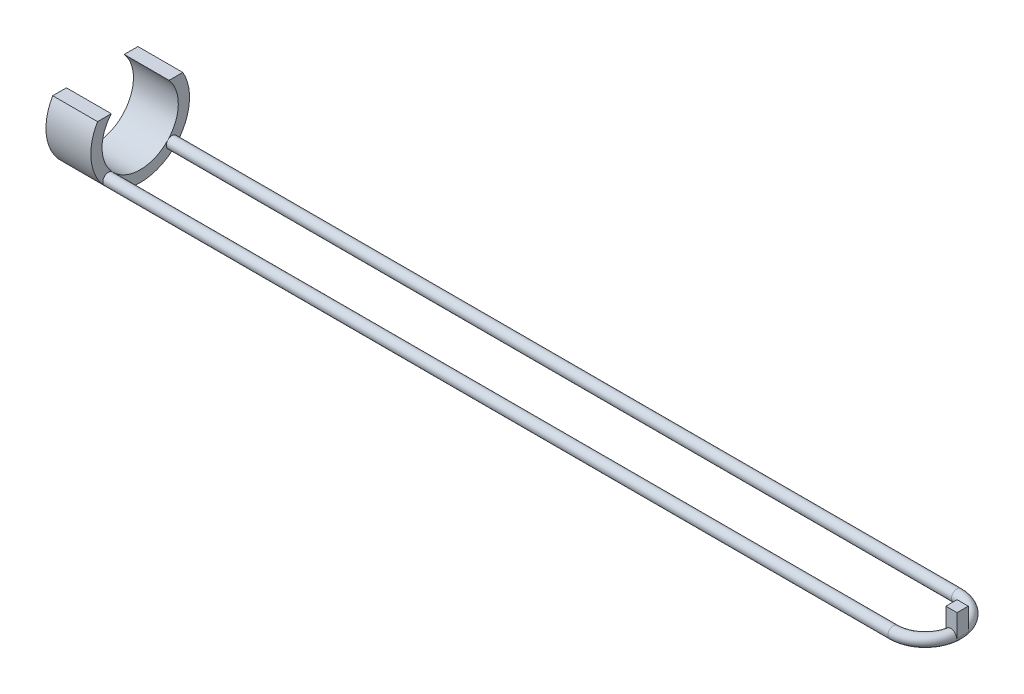
ISO-10303-21;
HEADER;
FILE_DESCRIPTION(('STEP AP214'),'2;1');
FILE_NAME('part.step','',(''),(''),'','','');
FILE_SCHEMA(('AUTOMOTIVE_DESIGN { 1 0 10303 214 1 1 1 1 }'));
ENDSEC;
DATA;
#1=APPLICATION_CONTEXT('core data for automotive mechanical design processes');
#2=APPLICATION_PROTOCOL_DEFINITION('international standard','automotive_design',2000,#1);
#3=PRODUCT_CONTEXT('',#1,'mechanical');
#4=PRODUCT('Part','Part','',(#3));
#5=PRODUCT_RELATED_PRODUCT_CATEGORY('part','',(#4));
#6=PRODUCT_DEFINITION_FORMATION('','',#4);
#7=PRODUCT_DEFINITION_CONTEXT('part definition',#1,'design');
#8=PRODUCT_DEFINITION('design','',#6,#7);
#9=PRODUCT_DEFINITION_SHAPE('','',#8);
#10=(LENGTH_UNIT() NAMED_UNIT(*) SI_UNIT(.MILLI.,.METRE.));
#11=(NAMED_UNIT(*) PLANE_ANGLE_UNIT() SI_UNIT($,.RADIAN.));
#12=(NAMED_UNIT(*) SI_UNIT($,.STERADIAN.) SOLID_ANGLE_UNIT());
#13=UNCERTAINTY_MEASURE_WITH_UNIT(LENGTH_MEASURE(1.E-05),#10,'distance_accuracy_value','');
#14=(GEOMETRIC_REPRESENTATION_CONTEXT(3) GLOBAL_UNCERTAINTY_ASSIGNED_CONTEXT((#13)) GLOBAL_UNIT_ASSIGNED_CONTEXT((#10,
#11,#12)) REPRESENTATION_CONTEXT('',''));
#15=CARTESIAN_POINT('',(0.,0.,0.));
#16=DIRECTION('',(0.,0.,1.));
#17=DIRECTION('',(1.,0.,0.));
#18=AXIS2_PLACEMENT_3D('',#15,#16,#17);
#19=CARTESIAN_POINT('',(361.7,-11.891570779201,2.5));
#20=DIRECTION('',(0.,0.,1.));
#21=DIRECTION('',(1.,0.,0.));
#22=AXIS2_PLACEMENT_3D('',#19,#20,#21);
#23=PLANE('',#22);
#24=DIRECTION('',(0.,-1.,0.));
#25=VECTOR('',#24,1.);
#26=CARTESIAN_POINT('',(366.7,-11.891570779201,2.5));
#27=LINE('',#26,#25);
#28=CARTESIAN_POINT('',(366.7,-1.89157077920098,2.5));
#29=VERTEX_POINT('',#28);
#30=CARTESIAN_POINT('',(366.7,-11.891570779201,2.5));
#31=VERTEX_POINT('',#30);
#32=EDGE_CURVE('E121',#29,#31,#27,.T.);
#33=ORIENTED_EDGE('',*,*,#32,.F.);
#34=DIRECTION('',(1.,0.,0.));
#35=VECTOR('',#34,1.);
#36=CARTESIAN_POINT('',(361.7,-1.89157077920098,2.5));
#37=LINE('',#36,#35);
#38=CARTESIAN_POINT('',(361.7,-1.89157077920098,2.5));
#39=VERTEX_POINT('',#38);
#40=EDGE_CURVE('E12',#39,#29,#37,.T.);
#41=ORIENTED_EDGE('',*,*,#40,.F.);
#42=DIRECTION('',(0.,-1.,0.));
#43=VECTOR('',#42,1.);
#44=CARTESIAN_POINT('',(361.7,-11.891570779201,2.5));
#45=LINE('',#44,#43);
#46=CARTESIAN_POINT('',(361.7,-11.891570779201,2.5));
#47=VERTEX_POINT('',#46);
#48=EDGE_CURVE('E115',#39,#47,#45,.T.);
#49=ORIENTED_EDGE('',*,*,#48,.T.);
#50=DIRECTION('',(1.,0.,0.));
#51=VECTOR('',#50,1.);
#52=CARTESIAN_POINT('',(361.7,-11.891570779201,2.5));
#53=LINE('',#52,#51);
#54=EDGE_CURVE('E60',#47,#31,#53,.T.);
#55=ORIENTED_EDGE('',*,*,#54,.T.);
#56=EDGE_LOOP('',(#33,#41,#49,#55));
#57=FACE_BOUND('',#56,.T.);
#58=ADVANCED_FACE('F57',(#57),#23,.T.);
#59=CARTESIAN_POINT('',(361.7,-1.89157077920098,2.5));
#60=DIRECTION('',(0.,1.,0.));
#61=DIRECTION('',(0.,0.,1.));
#62=AXIS2_PLACEMENT_3D('',#59,#60,#61);
#63=PLANE('',#62);
#64=DIRECTION('',(0.,0.,1.));
#65=VECTOR('',#64,1.);
#66=CARTESIAN_POINT('',(366.7,-1.89157077920098,2.5));
#67=LINE('',#66,#65);
#68=CARTESIAN_POINT('',(366.7,-1.89157077920098,-2.5));
#69=VERTEX_POINT('',#68);
#70=EDGE_CURVE('E117',#69,#29,#67,.T.);
#71=ORIENTED_EDGE('',*,*,#70,.F.);
#72=DIRECTION('',(1.,0.,0.));
#73=VECTOR('',#72,1.);
#74=CARTESIAN_POINT('',(361.7,-1.89157077920098,-2.5));
#75=LINE('',#74,#73);
#76=CARTESIAN_POINT('',(361.7,-1.89157077920098,-2.5));
#77=VERTEX_POINT('',#76);
#78=EDGE_CURVE('E66',#77,#69,#75,.T.);
#79=ORIENTED_EDGE('',*,*,#78,.F.);
#80=DIRECTION('',(0.,0.,1.));
#81=VECTOR('',#80,1.);
#82=CARTESIAN_POINT('',(361.7,-1.89157077920098,2.5));
#83=LINE('',#82,#81);
#84=EDGE_CURVE('E112',#77,#39,#83,.T.);
#85=ORIENTED_EDGE('',*,*,#84,.T.);
#86=ORIENTED_EDGE('',*,*,#40,.T.);
#87=EDGE_LOOP('',(#71,#79,#85,#86));
#88=FACE_BOUND('',#87,.T.);
#89=ADVANCED_FACE('F131',(#88),#63,.T.);
#90=CARTESIAN_POINT('',(361.7,-11.891570779201,-2.5));
#91=DIRECTION('',(0.,0.,-1.));
#92=DIRECTION('',(-1.,0.,0.));
#93=AXIS2_PLACEMENT_3D('',#90,#91,#92);
#94=PLANE('',#93);
#95=DIRECTION('',(0.,1.,0.));
#96=VECTOR('',#95,1.);
#97=CARTESIAN_POINT('',(366.7,-11.891570779201,-2.5));
#98=LINE('',#97,#96);
#99=CARTESIAN_POINT('',(366.7,-11.891570779201,-2.5));
#100=VERTEX_POINT('',#99);
#101=EDGE_CURVE('E107',#100,#69,#98,.T.);
#102=ORIENTED_EDGE('',*,*,#101,.F.);
#103=DIRECTION('',(1.,0.,0.));
#104=VECTOR('',#103,1.);
#105=CARTESIAN_POINT('',(361.7,-11.891570779201,-2.5));
#106=LINE('',#105,#104);
#107=CARTESIAN_POINT('',(361.7,-11.891570779201,-2.5));
#108=VERTEX_POINT('',#107);
#109=EDGE_CURVE('E102',#108,#100,#106,.T.);
#110=ORIENTED_EDGE('',*,*,#109,.F.);
#111=DIRECTION('',(0.,1.,0.));
#112=VECTOR('',#111,1.);
#113=CARTESIAN_POINT('',(361.7,-11.891570779201,-2.5));
#114=LINE('',#113,#112);
#115=EDGE_CURVE('E105',#108,#77,#114,.T.);
#116=ORIENTED_EDGE('',*,*,#115,.T.);
#117=ORIENTED_EDGE('',*,*,#78,.T.);
#118=EDGE_LOOP('',(#102,#110,#116,#117));
#119=FACE_BOUND('',#118,.T.);
#120=ADVANCED_FACE('F104',(#119),#94,.T.);
#121=CARTESIAN_POINT('',(361.7,-11.891570779201,2.5));
#122=DIRECTION('',(0.,-1.,0.));
#123=DIRECTION('',(0.,0.,-1.));
#124=AXIS2_PLACEMENT_3D('',#121,#122,#123);
#125=PLANE('',#124);
#126=DIRECTION('',(0.,0.,-1.));
#127=VECTOR('',#126,1.);
#128=CARTESIAN_POINT('',(366.7,-11.891570779201,2.5));
#129=LINE('',#128,#127);
#130=EDGE_CURVE('E124',#31,#100,#129,.T.);
#131=ORIENTED_EDGE('',*,*,#130,.F.);
#132=ORIENTED_EDGE('',*,*,#54,.F.);
#133=DIRECTION('',(0.,0.,-1.));
#134=VECTOR('',#133,1.);
#135=CARTESIAN_POINT('',(361.7,-11.891570779201,2.5));
#136=LINE('',#135,#134);
#137=EDGE_CURVE('E111',#47,#108,#136,.T.);
#138=ORIENTED_EDGE('',*,*,#137,.T.);
#139=ORIENTED_EDGE('',*,*,#109,.T.);
#140=EDGE_LOOP('',(#131,#132,#138,#139));
#141=FACE_BOUND('',#140,.T.);
#142=ADVANCED_FACE('F114',(#141),#125,.T.);
#143=CARTESIAN_POINT('',(361.7,0.,0.));
#144=DIRECTION('',(-1.,0.,0.));
#145=DIRECTION('',(0.,0.,1.));
#146=AXIS2_PLACEMENT_3D('',#143,#144,#145);
#147=PLANE('',#146);
#148=ORIENTED_EDGE('',*,*,#48,.F.);
#149=ORIENTED_EDGE('',*,*,#84,.F.);
#150=ORIENTED_EDGE('',*,*,#115,.F.);
#151=ORIENTED_EDGE('',*,*,#137,.F.);
#152=EDGE_LOOP('',(#148,#149,#150,#151));
#153=FACE_BOUND('',#152,.T.);
#154=ADVANCED_FACE('F110',(#153),#147,.T.);
#155=CARTESIAN_POINT('',(366.7,0.,0.));
#156=DIRECTION('',(-1.,0.,0.));
#157=DIRECTION('',(0.,0.,1.));
#158=AXIS2_PLACEMENT_3D('',#155,#156,#157);
#159=PLANE('',#158);
#160=ORIENTED_EDGE('',*,*,#32,.T.);
#161=ORIENTED_EDGE('',*,*,#130,.T.);
#162=ORIENTED_EDGE('',*,*,#101,.T.);
#163=ORIENTED_EDGE('',*,*,#70,.T.);
#164=EDGE_LOOP('',(#160,#161,#162,#163));
#165=FACE_BOUND('',#164,.T.);
#166=ADVANCED_FACE('F130',(#165),#159,.F.);
#167=CLOSED_SHELL('',(#58,#89,#120,#142,#154,#166));
#168=MANIFOLD_SOLID_BREP('B2',#167);
#169=CARTESIAN_POINT('',(350.,-11.891570779201,-14.1718221977011));
#170=DIRECTION('',(-1.,0.,0.));
#171=DIRECTION('',(0.,0.,1.));
#172=AXIS2_PLACEMENT_3D('',#169,#170,#171);
#173=CYLINDRICAL_SURFACE('',#172,2.5);
#174=CARTESIAN_POINT('',(350.,-11.891570779201,-14.1718221977011));
#175=DIRECTION('',(1.,0.,0.));
#176=DIRECTION('',(0.,0.,-1.));
#177=AXIS2_PLACEMENT_3D('',#174,#175,#176);
#178=CIRCLE('',#177,2.5);
#179=CARTESIAN_POINT('',(350.,-11.891570779201,-16.6718221977011));
#180=VERTEX_POINT('',#179);
#181=EDGE_CURVE('E55',#180,#180,#178,.T.);
#182=ORIENTED_EDGE('',*,*,#181,.F.);
#183=EDGE_LOOP('',(#182));
#184=FACE_BOUND('',#183,.T.);
#185=CARTESIAN_POINT('',(0.,-11.891570779201,-14.1718221977011));
#186=DIRECTION('',(1.,0.,0.));
#187=DIRECTION('',(0.,0.,-1.));
#188=AXIS2_PLACEMENT_3D('',#185,#186,#187);
#189=CIRCLE('',#188,2.5);
#190=CARTESIAN_POINT('',(0.,-10.1743423825825,-12.3549219159445));
#191=VERTEX_POINT('',#190);
#192=CARTESIAN_POINT('',(0.,-13.6087991758195,-15.9887224794577));
#193=VERTEX_POINT('',#192);
#194=EDGE_CURVE('E184',#191,#193,#189,.T.);
#195=ORIENTED_EDGE('',*,*,#194,.T.);
#196=EDGE_CURVE('E260',#193,#191,#189,.T.);
#197=ORIENTED_EDGE('',*,*,#196,.T.);
#198=EDGE_LOOP('',(#195,#197));
#199=FACE_BOUND('',#198,.T.);
#200=ADVANCED_FACE('F181',(#184,#199),#173,.T.);
#201=CARTESIAN_POINT('',(350.,-11.891570779201,0.));
#202=DIRECTION('',(0.,-1.,0.));
#203=DIRECTION('',(0.,0.,-1.));
#204=AXIS2_PLACEMENT_3D('',#201,#202,#203);
#205=TOROIDAL_SURFACE('',#204,14.1718221977011,2.5);
#206=CARTESIAN_POINT('',(350.,-11.891570779201,14.1718221977011));
#207=DIRECTION('',(1.,0.,0.));
#208=DIRECTION('',(0.,0.,-1.));
#209=AXIS2_PLACEMENT_3D('',#206,#207,#208);
#210=CIRCLE('',#209,2.5);
#211=CARTESIAN_POINT('',(350.,-11.891570779201,16.6718221977011));
#212=VERTEX_POINT('',#211);
#213=EDGE_CURVE('E297',#212,#212,#210,.T.);
#214=CARTESIAN_POINT('',(350.,-11.891570779201,0.));
#215=DIRECTION('',(0.,-1.,0.));
#216=DIRECTION('',(0.,0.,-1.));
#217=AXIS2_PLACEMENT_3D('',#214,#215,#216);
#218=CIRCLE('',#217,16.6718221977011);
#219=EDGE_CURVE('',#180,#212,#218,.T.);
#220=ORIENTED_EDGE('',*,*,#181,.T.);
#221=ORIENTED_EDGE('',*,*,#213,.T.);
#222=ORIENTED_EDGE('',*,*,#219,.T.);
#223=ORIENTED_EDGE('',*,*,#219,.F.);
#224=EDGE_LOOP('',(#220,#222,#221,#223));
#225=FACE_BOUND('',#224,.T.);
#226=ADVANCED_FACE('F337',(#225),#205,.T.);
#227=CARTESIAN_POINT('',(350.,-11.891570779201,14.1718221977011));
#228=DIRECTION('',(-1.,0.,0.));
#229=DIRECTION('',(0.,0.,1.));
#230=AXIS2_PLACEMENT_3D('',#227,#228,#229);
#231=CYLINDRICAL_SURFACE('',#230,2.5);
#232=ORIENTED_EDGE('',*,*,#213,.F.);
#233=EDGE_LOOP('',(#232));
#234=FACE_BOUND('',#233,.T.);
#235=CARTESIAN_POINT('',(0.,-11.891570779201,14.1718221977011));
#236=DIRECTION('',(1.,0.,0.));
#237=DIRECTION('',(0.,0.,-1.));
#238=AXIS2_PLACEMENT_3D('',#235,#236,#237);
#239=CIRCLE('',#238,2.5);
#240=CARTESIAN_POINT('',(0.,-10.1743423825825,12.3549219159445));
#241=VERTEX_POINT('',#240);
#242=CARTESIAN_POINT('',(0.,-13.6087991758195,15.9887224794576));
#243=VERTEX_POINT('',#242);
#244=EDGE_CURVE('E293',#241,#243,#239,.T.);
#245=ORIENTED_EDGE('',*,*,#244,.T.);
#246=EDGE_CURVE('E298',#243,#241,#239,.T.);
#247=ORIENTED_EDGE('',*,*,#246,.T.);
#248=EDGE_LOOP('',(#245,#247));
#249=FACE_BOUND('',#248,.T.);
#250=ADVANCED_FACE('F311',(#234,#249),#231,.T.);
#251=CARTESIAN_POINT('',(0.,0.,0.));
#252=DIRECTION('',(-1.,0.,0.));
#253=DIRECTION('',(0.,0.,1.));
#254=AXIS2_PLACEMENT_3D('',#251,#252,#253);
#255=PLANE('',#254);
#256=ORIENTED_EDGE('',*,*,#194,.F.);
#257=CARTESIAN_POINT('',(0.,1.50281071442336,0.));
#258=DIRECTION('',(-1.,0.,0.));
#259=DIRECTION('',(0.,0.,1.));
#260=AXIS2_PLACEMENT_3D('',#257,#258,#259);
#261=CIRCLE('',#260,17.);
#262=EDGE_CURVE('E203',#191,#241,#261,.T.);
#263=ORIENTED_EDGE('',*,*,#262,.T.);
#264=ORIENTED_EDGE('',*,*,#246,.F.);
#265=CARTESIAN_POINT('',(0.,1.50281071442336,0.));
#266=DIRECTION('',(-1.,0.,0.));
#267=DIRECTION('',(0.,0.,1.));
#268=AXIS2_PLACEMENT_3D('',#265,#266,#267);
#269=CIRCLE('',#268,22.);
#270=EDGE_CURVE('E278',#193,#243,#269,.T.);
#271=ORIENTED_EDGE('',*,*,#270,.F.);
#272=EDGE_LOOP('',(#256,#263,#264,#271));
#273=FACE_BOUND('',#272,.T.);
#274=ADVANCED_FACE('F314',(#273),#255,.F.);
#275=ORIENTED_EDGE('',*,*,#196,.F.);
#276=CARTESIAN_POINT('',(0.,12.5933472208328,-19.));
#277=VERTEX_POINT('',#276);
#278=EDGE_CURVE('E274',#277,#193,#269,.T.);
#279=ORIENTED_EDGE('',*,*,#278,.F.);
#280=DIRECTION('',(0.,0.,1.));
#281=VECTOR('',#280,1.);
#282=CARTESIAN_POINT('',(0.,12.5933472208328,0.));
#283=LINE('',#282,#281);
#284=CARTESIAN_POINT('',(0.,12.5933472208328,-12.8840987267251));
#285=VERTEX_POINT('',#284);
#286=EDGE_CURVE('E247',#277,#285,#283,.T.);
#287=ORIENTED_EDGE('',*,*,#286,.T.);
#288=EDGE_CURVE('E196',#285,#191,#261,.T.);
#289=ORIENTED_EDGE('',*,*,#288,.T.);
#290=EDGE_LOOP('',(#275,#279,#287,#289));
#291=FACE_BOUND('',#290,.T.);
#292=ADVANCED_FACE('F327',(#291),#255,.F.);
#293=ORIENTED_EDGE('',*,*,#244,.F.);
#294=CARTESIAN_POINT('',(0.,12.5933472208328,12.8840987267251));
#295=VERTEX_POINT('',#294);
#296=EDGE_CURVE('E281',#241,#295,#261,.T.);
#297=ORIENTED_EDGE('',*,*,#296,.T.);
#298=DIRECTION('',(0.,0.,1.));
#299=VECTOR('',#298,1.);
#300=CARTESIAN_POINT('',(0.,12.5933472208328,0.));
#301=LINE('',#300,#299);
#302=CARTESIAN_POINT('',(0.,12.5933472208328,19.));
#303=VERTEX_POINT('',#302);
#304=EDGE_CURVE('E277',#295,#303,#301,.T.);
#305=ORIENTED_EDGE('',*,*,#304,.T.);
#306=EDGE_CURVE('E255',#243,#303,#269,.T.);
#307=ORIENTED_EDGE('',*,*,#306,.F.);
#308=EDGE_LOOP('',(#293,#297,#305,#307));
#309=FACE_BOUND('',#308,.T.);
#310=ADVANCED_FACE('F316',(#309),#255,.F.);
#311=CARTESIAN_POINT('',(-20.,1.50281071442336,0.));
#312=DIRECTION('',(1.,0.,0.));
#313=DIRECTION('',(0.,0.,-1.));
#314=AXIS2_PLACEMENT_3D('',#311,#312,#313);
#315=CYLINDRICAL_SURFACE('',#314,22.);
#316=ORIENTED_EDGE('',*,*,#278,.T.);
#317=ORIENTED_EDGE('',*,*,#270,.T.);
#318=ORIENTED_EDGE('',*,*,#306,.T.);
#319=DIRECTION('',(1.,0.,0.));
#320=VECTOR('',#319,1.);
#321=CARTESIAN_POINT('',(-20.,12.5933472208328,19.));
#322=LINE('',#321,#320);
#323=CARTESIAN_POINT('',(-20.,12.5933472208328,19.));
#324=VERTEX_POINT('',#323);
#325=EDGE_CURVE('E250',#324,#303,#322,.T.);
#326=ORIENTED_EDGE('',*,*,#325,.F.);
#327=CARTESIAN_POINT('',(-20.,1.50281071442336,0.));
#328=DIRECTION('',(-1.,0.,0.));
#329=DIRECTION('',(0.,0.,1.));
#330=AXIS2_PLACEMENT_3D('',#327,#328,#329);
#331=CIRCLE('',#330,22.);
#332=CARTESIAN_POINT('',(-20.,12.5933472208328,-19.));
#333=VERTEX_POINT('',#332);
#334=EDGE_CURVE('E236',#333,#324,#331,.T.);
#335=ORIENTED_EDGE('',*,*,#334,.F.);
#336=DIRECTION('',(1.,0.,0.));
#337=VECTOR('',#336,1.);
#338=CARTESIAN_POINT('',(-20.,12.5933472208328,-19.));
#339=LINE('',#338,#337);
#340=EDGE_CURVE('E273',#333,#277,#339,.T.);
#341=ORIENTED_EDGE('',*,*,#340,.T.);
#342=EDGE_LOOP('',(#316,#317,#318,#326,#335,#341));
#343=FACE_BOUND('',#342,.T.);
#344=ADVANCED_FACE('F252',(#343),#315,.T.);
#345=CARTESIAN_POINT('',(-20.,12.5933472208328,0.));
#346=DIRECTION('',(0.,1.,0.));
#347=DIRECTION('',(0.,0.,1.));
#348=AXIS2_PLACEMENT_3D('',#345,#346,#347);
#349=PLANE('',#348);
#350=ORIENTED_EDGE('',*,*,#304,.F.);
#351=DIRECTION('',(1.,0.,0.));
#352=VECTOR('',#351,1.);
#353=CARTESIAN_POINT('',(-20.,12.5933472208328,12.8840987267251));
#354=LINE('',#353,#352);
#355=CARTESIAN_POINT('',(-20.,12.5933472208328,12.8840987267251));
#356=VERTEX_POINT('',#355);
#357=EDGE_CURVE('E261',#356,#295,#354,.T.);
#358=ORIENTED_EDGE('',*,*,#357,.F.);
#359=DIRECTION('',(0.,0.,1.));
#360=VECTOR('',#359,1.);
#361=CARTESIAN_POINT('',(-20.,12.5933472208328,0.));
#362=LINE('',#361,#360);
#363=EDGE_CURVE('E241',#356,#324,#362,.T.);
#364=ORIENTED_EDGE('',*,*,#363,.T.);
#365=ORIENTED_EDGE('',*,*,#325,.T.);
#366=EDGE_LOOP('',(#350,#358,#364,#365));
#367=FACE_BOUND('',#366,.T.);
#368=ADVANCED_FACE('F263',(#367),#349,.T.);
#369=CARTESIAN_POINT('',(-20.,1.50281071442336,0.));
#370=DIRECTION('',(1.,0.,0.));
#371=DIRECTION('',(0.,0.,-1.));
#372=AXIS2_PLACEMENT_3D('',#369,#370,#371);
#373=CYLINDRICAL_SURFACE('',#372,17.);
#374=ORIENTED_EDGE('',*,*,#288,.F.);
#375=DIRECTION('',(1.,0.,0.));
#376=VECTOR('',#375,1.);
#377=CARTESIAN_POINT('',(-20.,12.5933472208328,-12.8840987267251));
#378=LINE('',#377,#376);
#379=CARTESIAN_POINT('',(-20.,12.5933472208328,-12.8840987267251));
#380=VERTEX_POINT('',#379);
#381=EDGE_CURVE('E288',#380,#285,#378,.T.);
#382=ORIENTED_EDGE('',*,*,#381,.F.);
#383=CARTESIAN_POINT('',(-20.,1.50281071442336,0.));
#384=DIRECTION('',(-1.,0.,0.));
#385=DIRECTION('',(0.,0.,1.));
#386=AXIS2_PLACEMENT_3D('',#383,#384,#385);
#387=CIRCLE('',#386,17.);
#388=EDGE_CURVE('E266',#380,#356,#387,.T.);
#389=ORIENTED_EDGE('',*,*,#388,.T.);
#390=ORIENTED_EDGE('',*,*,#357,.T.);
#391=ORIENTED_EDGE('',*,*,#296,.F.);
#392=ORIENTED_EDGE('',*,*,#262,.F.);
#393=EDGE_LOOP('',(#374,#382,#389,#390,#391,#392));
#394=FACE_BOUND('',#393,.T.);
#395=ADVANCED_FACE('F323',(#394),#373,.F.);
#396=CARTESIAN_POINT('',(-20.,12.5933472208328,0.));
#397=DIRECTION('',(0.,1.,0.));
#398=DIRECTION('',(0.,0.,1.));
#399=AXIS2_PLACEMENT_3D('',#396,#397,#398);
#400=PLANE('',#399);
#401=ORIENTED_EDGE('',*,*,#286,.F.);
#402=ORIENTED_EDGE('',*,*,#340,.F.);
#403=DIRECTION('',(0.,0.,1.));
#404=VECTOR('',#403,1.);
#405=CARTESIAN_POINT('',(-20.,12.5933472208328,0.));
#406=LINE('',#405,#404);
#407=EDGE_CURVE('E244',#333,#380,#406,.T.);
#408=ORIENTED_EDGE('',*,*,#407,.T.);
#409=ORIENTED_EDGE('',*,*,#381,.T.);
#410=EDGE_LOOP('',(#401,#402,#408,#409));
#411=FACE_BOUND('',#410,.T.);
#412=ADVANCED_FACE('F326',(#411),#400,.T.);
#413=CARTESIAN_POINT('',(-20.,0.,0.));
#414=DIRECTION('',(-1.,0.,0.));
#415=DIRECTION('',(0.,0.,1.));
#416=AXIS2_PLACEMENT_3D('',#413,#414,#415);
#417=PLANE('',#416);
#418=ORIENTED_EDGE('',*,*,#334,.T.);
#419=ORIENTED_EDGE('',*,*,#363,.F.);
#420=ORIENTED_EDGE('',*,*,#388,.F.);
#421=ORIENTED_EDGE('',*,*,#407,.F.);
#422=EDGE_LOOP('',(#418,#419,#420,#421));
#423=FACE_BOUND('',#422,.T.);
#424=ADVANCED_FACE('F238',(#423),#417,.T.);
#425=CLOSED_SHELL('',(#200,#226,#250,#274,#292,#310,#344,#368,#395,#412,#424));
#426=MANIFOLD_SOLID_BREP('B6',#425);
#427=ADVANCED_BREP_SHAPE_REPRESENTATION('',(#18,#168,#426),#14);
#428=SHAPE_DEFINITION_REPRESENTATION(#9,#427);
ENDSEC;
END-ISO-10303-21;
